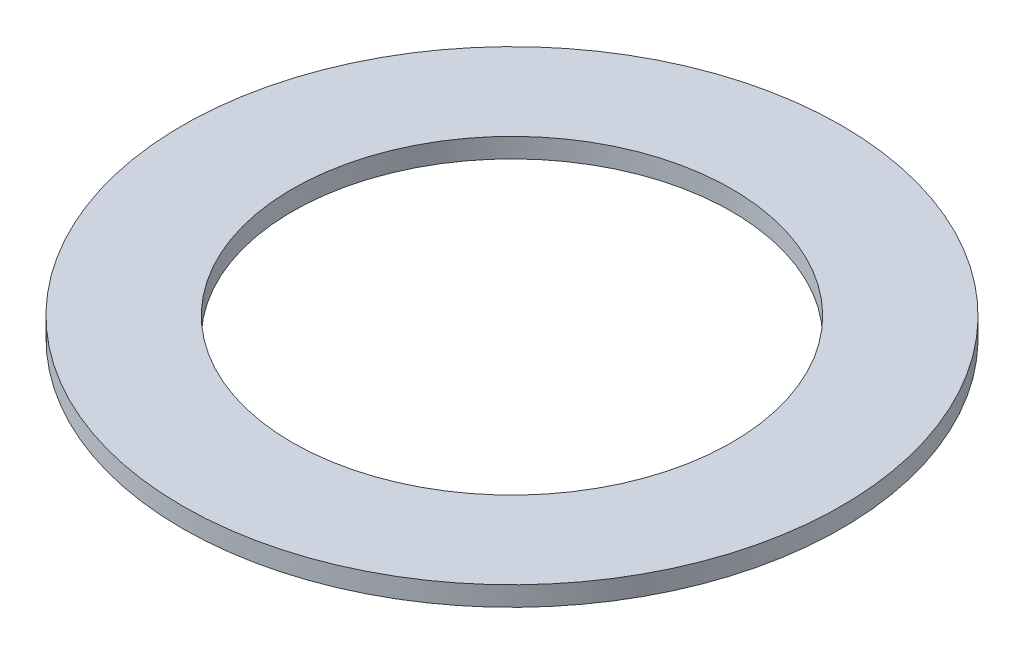
ISO-10303-21;
HEADER;
FILE_DESCRIPTION(('STEP AP214'),'2;1');
FILE_NAME('part.step','',(''),(''),'','','');
FILE_SCHEMA(('AUTOMOTIVE_DESIGN { 1 0 10303 214 1 1 1 1 }'));
ENDSEC;
DATA;
#1=APPLICATION_CONTEXT('core data for automotive mechanical design processes');
#2=APPLICATION_PROTOCOL_DEFINITION('international standard','automotive_design',2000,#1);
#3=PRODUCT_CONTEXT('',#1,'mechanical');
#4=PRODUCT('Part','Part','',(#3));
#5=PRODUCT_RELATED_PRODUCT_CATEGORY('part','',(#4));
#6=PRODUCT_DEFINITION_FORMATION('','',#4);
#7=PRODUCT_DEFINITION_CONTEXT('part definition',#1,'design');
#8=PRODUCT_DEFINITION('design','',#6,#7);
#9=PRODUCT_DEFINITION_SHAPE('','',#8);
#10=(LENGTH_UNIT() NAMED_UNIT(*) SI_UNIT(.MILLI.,.METRE.));
#11=(NAMED_UNIT(*) PLANE_ANGLE_UNIT() SI_UNIT($,.RADIAN.));
#12=(NAMED_UNIT(*) SI_UNIT($,.STERADIAN.) SOLID_ANGLE_UNIT());
#13=UNCERTAINTY_MEASURE_WITH_UNIT(LENGTH_MEASURE(1.E-05),#10,'distance_accuracy_value','');
#14=(GEOMETRIC_REPRESENTATION_CONTEXT(3) GLOBAL_UNCERTAINTY_ASSIGNED_CONTEXT((#13)) GLOBAL_UNIT_ASSIGNED_CONTEXT((#10,
#11,#12)) REPRESENTATION_CONTEXT('',''));
#15=CARTESIAN_POINT('',(0.,0.,0.));
#16=DIRECTION('',(0.,0.,1.));
#17=DIRECTION('',(1.,0.,0.));
#18=AXIS2_PLACEMENT_3D('',#15,#16,#17);
#19=CARTESIAN_POINT('',(0.,4.,0.));
#20=DIRECTION('',(0.,-1.,0.));
#21=DIRECTION('',(0.,0.,-1.));
#22=AXIS2_PLACEMENT_3D('',#19,#20,#21);
#23=CYLINDRICAL_SURFACE('',#22,67.5);
#24=CARTESIAN_POINT('',(0.,4.,0.));
#25=DIRECTION('',(0.,1.,0.));
#26=DIRECTION('',(0.,0.,1.));
#27=AXIS2_PLACEMENT_3D('',#24,#25,#26);
#28=CIRCLE('',#27,67.5);
#29=CARTESIAN_POINT('',(0.,4.,67.5));
#30=VERTEX_POINT('',#29);
#31=EDGE_CURVE('E10',#30,#30,#28,.T.);
#32=ORIENTED_EDGE('',*,*,#31,.F.);
#33=EDGE_LOOP('',(#32));
#34=FACE_BOUND('',#33,.T.);
#35=CARTESIAN_POINT('',(0.,0.,0.));
#36=DIRECTION('',(0.,1.,0.));
#37=DIRECTION('',(0.,0.,1.));
#38=AXIS2_PLACEMENT_3D('',#35,#36,#37);
#39=CIRCLE('',#38,67.5);
#40=CARTESIAN_POINT('',(0.,0.,67.5));
#41=VERTEX_POINT('',#40);
#42=EDGE_CURVE('E37',#41,#41,#39,.T.);
#43=ORIENTED_EDGE('',*,*,#42,.T.);
#44=EDGE_LOOP('',(#43));
#45=FACE_BOUND('',#44,.T.);
#46=ADVANCED_FACE('F40',(#34,#45),#23,.T.);
#47=CARTESIAN_POINT('',(0.,4.,0.));
#48=DIRECTION('',(0.,1.,0.));
#49=DIRECTION('',(0.,0.,1.));
#50=AXIS2_PLACEMENT_3D('',#47,#48,#49);
#51=PLANE('',#50);
#52=CARTESIAN_POINT('',(0.,4.,0.));
#53=DIRECTION('',(0.,1.,0.));
#54=DIRECTION('',(0.,0.,1.));
#55=AXIS2_PLACEMENT_3D('',#52,#53,#54);
#56=CIRCLE('',#55,45.);
#57=CARTESIAN_POINT('',(0.,4.,45.));
#58=VERTEX_POINT('',#57);
#59=EDGE_CURVE('E50',#58,#58,#56,.T.);
#60=ORIENTED_EDGE('',*,*,#59,.F.);
#61=EDGE_LOOP('',(#60));
#62=FACE_BOUND('',#61,.T.);
#63=ORIENTED_EDGE('',*,*,#31,.T.);
#64=EDGE_LOOP('',(#63));
#65=FACE_BOUND('',#64,.T.);
#66=ADVANCED_FACE('F59',(#62,#65),#51,.T.);
#67=CARTESIAN_POINT('',(0.,0.,0.));
#68=DIRECTION('',(0.,1.,0.));
#69=DIRECTION('',(0.,0.,1.));
#70=AXIS2_PLACEMENT_3D('',#67,#68,#69);
#71=PLANE('',#70);
#72=CARTESIAN_POINT('',(0.,0.,0.));
#73=DIRECTION('',(0.,1.,0.));
#74=DIRECTION('',(0.,0.,1.));
#75=AXIS2_PLACEMENT_3D('',#72,#73,#74);
#76=CIRCLE('',#75,45.);
#77=CARTESIAN_POINT('',(0.,0.,45.));
#78=VERTEX_POINT('',#77);
#79=EDGE_CURVE('E47',#78,#78,#76,.T.);
#80=ORIENTED_EDGE('',*,*,#79,.T.);
#81=EDGE_LOOP('',(#80));
#82=FACE_BOUND('',#81,.T.);
#83=ORIENTED_EDGE('',*,*,#42,.F.);
#84=EDGE_LOOP('',(#83));
#85=FACE_BOUND('',#84,.T.);
#86=ADVANCED_FACE('F58',(#82,#85),#71,.F.);
#87=CARTESIAN_POINT('',(0.,4.,0.));
#88=DIRECTION('',(0.,-1.,0.));
#89=DIRECTION('',(0.,0.,-1.));
#90=AXIS2_PLACEMENT_3D('',#87,#88,#89);
#91=CYLINDRICAL_SURFACE('',#90,45.);
#92=ORIENTED_EDGE('',*,*,#59,.T.);
#93=EDGE_LOOP('',(#92));
#94=FACE_BOUND('',#93,.T.);
#95=ORIENTED_EDGE('',*,*,#79,.F.);
#96=EDGE_LOOP('',(#95));
#97=FACE_BOUND('',#96,.T.);
#98=ADVANCED_FACE('F54',(#94,#97),#91,.F.);
#99=CLOSED_SHELL('',(#46,#66,#86,#98));
#100=MANIFOLD_SOLID_BREP('B2',#99);
#101=ADVANCED_BREP_SHAPE_REPRESENTATION('',(#18,#100),#14);
#102=SHAPE_DEFINITION_REPRESENTATION(#9,#101);
ENDSEC;
END-ISO-10303-21;
